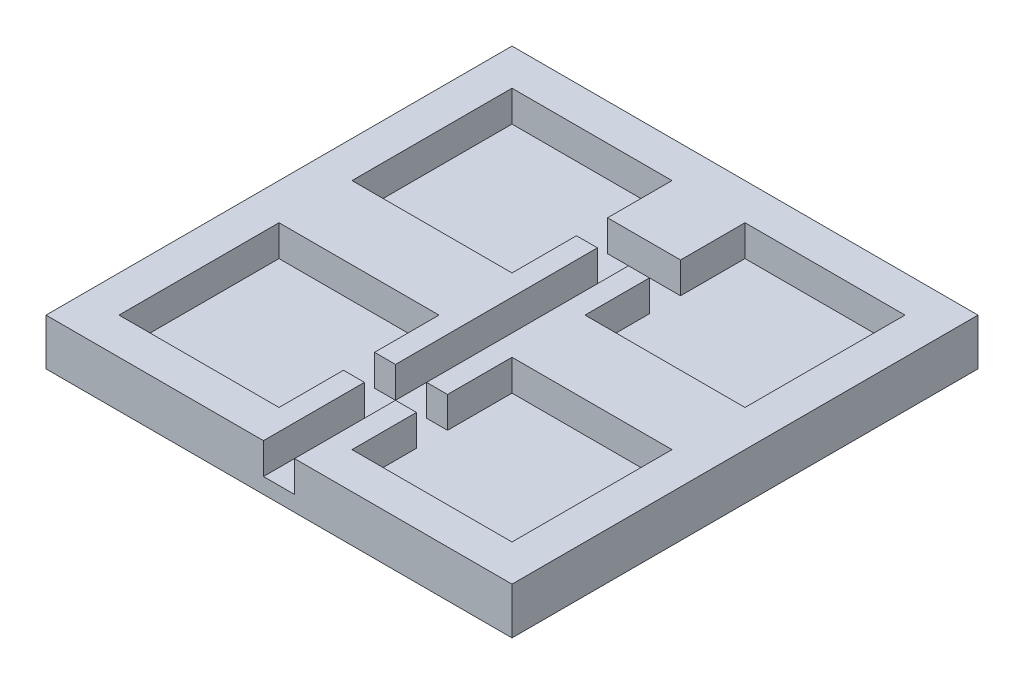
ISO-10303-21;
HEADER;
FILE_DESCRIPTION(('STEP AP214'),'2;1');
FILE_NAME('part.step','',(''),(''),'','','');
FILE_SCHEMA(('AUTOMOTIVE_DESIGN { 1 0 10303 214 1 1 1 1 }'));
ENDSEC;
DATA;
#1=APPLICATION_CONTEXT('core data for automotive mechanical design processes');
#2=APPLICATION_PROTOCOL_DEFINITION('international standard','automotive_design',2000,#1);
#3=PRODUCT_CONTEXT('',#1,'mechanical');
#4=PRODUCT('Part','Part','',(#3));
#5=PRODUCT_RELATED_PRODUCT_CATEGORY('part','',(#4));
#6=PRODUCT_DEFINITION_FORMATION('','',#4);
#7=PRODUCT_DEFINITION_CONTEXT('part definition',#1,'design');
#8=PRODUCT_DEFINITION('design','',#6,#7);
#9=PRODUCT_DEFINITION_SHAPE('','',#8);
#10=(LENGTH_UNIT() NAMED_UNIT(*) SI_UNIT(.MILLI.,.METRE.));
#11=(NAMED_UNIT(*) PLANE_ANGLE_UNIT() SI_UNIT($,.RADIAN.));
#12=(NAMED_UNIT(*) SI_UNIT($,.STERADIAN.) SOLID_ANGLE_UNIT());
#13=UNCERTAINTY_MEASURE_WITH_UNIT(LENGTH_MEASURE(1.E-05),#10,'distance_accuracy_value','');
#14=(GEOMETRIC_REPRESENTATION_CONTEXT(3) GLOBAL_UNCERTAINTY_ASSIGNED_CONTEXT((#13)) GLOBAL_UNIT_ASSIGNED_CONTEXT((#10,
#11,#12)) REPRESENTATION_CONTEXT('',''));
#15=CARTESIAN_POINT('',(0.,0.,0.));
#16=DIRECTION('',(0.,0.,1.));
#17=DIRECTION('',(1.,0.,0.));
#18=AXIS2_PLACEMENT_3D('',#15,#16,#17);
#19=CARTESIAN_POINT('',(2.35000000000002,1.,6.50000000000001));
#20=DIRECTION('',(0.,0.,-1.));
#21=DIRECTION('',(-1.,0.,0.));
#22=AXIS2_PLACEMENT_3D('',#19,#20,#21);
#23=PLANE('',#22);
#24=DIRECTION('',(-1.,0.,0.));
#25=VECTOR('',#24,1.);
#26=CARTESIAN_POINT('',(2.35000000000002,3.,6.50000000000001));
#27=LINE('',#26,#25);
#28=CARTESIAN_POINT('',(2.35000000000002,3.,6.50000000000001));
#29=VERTEX_POINT('',#28);
#30=CARTESIAN_POINT('',(1.,3.,6.50000000000001));
#31=VERTEX_POINT('',#30);
#32=EDGE_CURVE('E537',#29,#31,#27,.T.);
#33=ORIENTED_EDGE('',*,*,#32,.T.);
#34=DIRECTION('',(0.,-1.,0.));
#35=VECTOR('',#34,1.);
#36=CARTESIAN_POINT('',(1.,1.,6.50000000000001));
#37=LINE('',#36,#35);
#38=CARTESIAN_POINT('',(1.,1.,6.50000000000001));
#39=VERTEX_POINT('',#38);
#40=EDGE_CURVE('E304',#31,#39,#37,.T.);
#41=ORIENTED_EDGE('',*,*,#40,.T.);
#42=DIRECTION('',(-1.,0.,0.));
#43=VECTOR('',#42,1.);
#44=CARTESIAN_POINT('',(2.35000000000002,1.,6.50000000000001));
#45=LINE('',#44,#43);
#46=CARTESIAN_POINT('',(2.35000000000002,1.,6.50000000000001));
#47=VERTEX_POINT('',#46);
#48=EDGE_CURVE('E529',#47,#39,#45,.T.);
#49=ORIENTED_EDGE('',*,*,#48,.F.);
#50=DIRECTION('',(0.,1.,0.));
#51=VECTOR('',#50,1.);
#52=CARTESIAN_POINT('',(2.35000000000002,1.,6.50000000000001));
#53=LINE('',#52,#51);
#54=EDGE_CURVE('E543',#47,#29,#53,.T.);
#55=ORIENTED_EDGE('',*,*,#54,.T.);
#56=EDGE_LOOP('',(#33,#41,#49,#55));
#57=FACE_BOUND('',#56,.T.);
#58=ADVANCED_FACE('F33',(#57),#23,.F.);
#59=CARTESIAN_POINT('',(2.35000000000002,1.,8.50000000000001));
#60=DIRECTION('',(0.,0.,1.));
#61=DIRECTION('',(1.,0.,0.));
#62=AXIS2_PLACEMENT_3D('',#59,#60,#61);
#63=PLANE('',#62);
#64=DIRECTION('',(1.,0.,0.));
#65=VECTOR('',#64,1.);
#66=CARTESIAN_POINT('',(2.35000000000002,1.,8.50000000000001));
#67=LINE('',#66,#65);
#68=CARTESIAN_POINT('',(1.,1.,8.50000000000001));
#69=VERTEX_POINT('',#68);
#70=CARTESIAN_POINT('',(2.35000000000002,1.,8.50000000000001));
#71=VERTEX_POINT('',#70);
#72=EDGE_CURVE('E528',#69,#71,#67,.T.);
#73=ORIENTED_EDGE('',*,*,#72,.F.);
#74=DIRECTION('',(0.,1.,0.));
#75=VECTOR('',#74,1.);
#76=CARTESIAN_POINT('',(1.,1.,8.50000000000001));
#77=LINE('',#76,#75);
#78=CARTESIAN_POINT('',(1.,3.,8.50000000000001));
#79=VERTEX_POINT('',#78);
#80=EDGE_CURVE('E520',#69,#79,#77,.T.);
#81=ORIENTED_EDGE('',*,*,#80,.T.);
#82=DIRECTION('',(1.,0.,0.));
#83=VECTOR('',#82,1.);
#84=CARTESIAN_POINT('',(2.35000000000002,3.,8.50000000000001));
#85=LINE('',#84,#83);
#86=CARTESIAN_POINT('',(2.35000000000002,3.,8.50000000000001));
#87=VERTEX_POINT('',#86);
#88=EDGE_CURVE('E309',#79,#87,#85,.T.);
#89=ORIENTED_EDGE('',*,*,#88,.T.);
#90=DIRECTION('',(0.,1.,0.));
#91=VECTOR('',#90,1.);
#92=CARTESIAN_POINT('',(2.35000000000002,1.,8.50000000000001));
#93=LINE('',#92,#91);
#94=EDGE_CURVE('E545',#71,#87,#93,.T.);
#95=ORIENTED_EDGE('',*,*,#94,.F.);
#96=EDGE_LOOP('',(#73,#81,#89,#95));
#97=FACE_BOUND('',#96,.T.);
#98=ADVANCED_FACE('F647',(#97),#63,.F.);
#99=CARTESIAN_POINT('',(-2.35000000000005,1.,-6.50000000000001));
#100=DIRECTION('',(0.,0.,1.));
#101=DIRECTION('',(1.,0.,0.));
#102=AXIS2_PLACEMENT_3D('',#99,#100,#101);
#103=PLANE('',#102);
#104=DIRECTION('',(1.,0.,0.));
#105=VECTOR('',#104,1.);
#106=CARTESIAN_POINT('',(-2.35000000000005,1.,-6.50000000000001));
#107=LINE('',#106,#105);
#108=CARTESIAN_POINT('',(1.,1.,-6.50000000000001));
#109=VERTEX_POINT('',#108);
#110=CARTESIAN_POINT('',(2.35000000000006,1.,-6.5));
#111=VERTEX_POINT('',#110);
#112=EDGE_CURVE('E293',#109,#111,#107,.T.);
#113=ORIENTED_EDGE('',*,*,#112,.F.);
#114=DIRECTION('',(0.,1.,0.));
#115=VECTOR('',#114,1.);
#116=CARTESIAN_POINT('',(1.,1.,-6.50000000000001));
#117=LINE('',#116,#115);
#118=CARTESIAN_POINT('',(1.,3.,-6.50000000000001));
#119=VERTEX_POINT('',#118);
#120=EDGE_CURVE('E56',#109,#119,#117,.T.);
#121=ORIENTED_EDGE('',*,*,#120,.T.);
#122=DIRECTION('',(1.,0.,0.));
#123=VECTOR('',#122,1.);
#124=CARTESIAN_POINT('',(-2.35000000000005,3.,-6.50000000000001));
#125=LINE('',#124,#123);
#126=CARTESIAN_POINT('',(2.35000000000002,3.,-6.50000000000001));
#127=VERTEX_POINT('',#126);
#128=EDGE_CURVE('E303',#119,#127,#125,.T.);
#129=ORIENTED_EDGE('',*,*,#128,.T.);
#130=DIRECTION('',(0.,1.,0.));
#131=VECTOR('',#130,1.);
#132=CARTESIAN_POINT('',(2.35000000000002,1.,-6.50000000000001));
#133=LINE('',#132,#131);
#134=EDGE_CURVE('E306',#111,#127,#133,.T.);
#135=ORIENTED_EDGE('',*,*,#134,.F.);
#136=EDGE_LOOP('',(#113,#121,#129,#135));
#137=FACE_BOUND('',#136,.T.);
#138=ADVANCED_FACE('F587',(#137),#103,.F.);
#139=CARTESIAN_POINT('',(-2.35000000000005,1.,12.65));
#140=DIRECTION('',(1.,0.,0.));
#141=DIRECTION('',(0.,0.,-1.));
#142=AXIS2_PLACEMENT_3D('',#139,#140,#141);
#143=PLANE('',#142);
#144=DIRECTION('',(0.,0.,-1.));
#145=VECTOR('',#144,1.);
#146=CARTESIAN_POINT('',(-2.35000000000005,1.,12.65));
#147=LINE('',#146,#145);
#148=CARTESIAN_POINT('',(-2.35000000000005,1.,6.50000000000001));
#149=VERTEX_POINT('',#148);
#150=CARTESIAN_POINT('',(-2.35000000000003,1.,2.35000000000001));
#151=VERTEX_POINT('',#150);
#152=EDGE_CURVE('E424',#149,#151,#147,.T.);
#153=ORIENTED_EDGE('',*,*,#152,.F.);
#154=DIRECTION('',(0.,1.,0.));
#155=VECTOR('',#154,1.);
#156=CARTESIAN_POINT('',(-2.35000000000005,1.,6.50000000000001));
#157=LINE('',#156,#155);
#158=CARTESIAN_POINT('',(-2.35000000000005,3.,6.50000000000001));
#159=VERTEX_POINT('',#158);
#160=EDGE_CURVE('E540',#149,#159,#157,.T.);
#161=ORIENTED_EDGE('',*,*,#160,.T.);
#162=DIRECTION('',(0.,0.,-1.));
#163=VECTOR('',#162,1.);
#164=CARTESIAN_POINT('',(-2.35000000000005,3.,12.65));
#165=LINE('',#164,#163);
#166=CARTESIAN_POINT('',(-2.35000000000003,3.,2.35000000000001));
#167=VERTEX_POINT('',#166);
#168=EDGE_CURVE('E436',#159,#167,#165,.T.);
#169=ORIENTED_EDGE('',*,*,#168,.T.);
#170=DIRECTION('',(0.,1.,0.));
#171=VECTOR('',#170,1.);
#172=CARTESIAN_POINT('',(-2.35000000000003,1.,2.35000000000001));
#173=LINE('',#172,#171);
#174=EDGE_CURVE('E445',#151,#167,#173,.T.);
#175=ORIENTED_EDGE('',*,*,#174,.F.);
#176=EDGE_LOOP('',(#153,#161,#169,#175));
#177=FACE_BOUND('',#176,.T.);
#178=ADVANCED_FACE('F572',(#177),#143,.F.);
#179=CARTESIAN_POINT('',(-2.34999999999999,1.,-2.35000000000008));
#180=DIRECTION('',(1.,0.,0.));
#181=DIRECTION('',(0.,0.,-1.));
#182=AXIS2_PLACEMENT_3D('',#179,#180,#181);
#183=PLANE('',#182);
#184=DIRECTION('',(0.,0.,-1.));
#185=VECTOR('',#184,1.);
#186=CARTESIAN_POINT('',(-2.34999999999999,3.,-2.35000000000008));
#187=LINE('',#186,#185);
#188=CARTESIAN_POINT('',(-2.34999999999999,3.,-2.35000000000008));
#189=VERTEX_POINT('',#188);
#190=CARTESIAN_POINT('',(-2.35000000000005,3.,-6.50000000000001));
#191=VERTEX_POINT('',#190);
#192=EDGE_CURVE('E333',#189,#191,#187,.T.);
#193=ORIENTED_EDGE('',*,*,#192,.T.);
#194=DIRECTION('',(0.,1.,0.));
#195=VECTOR('',#194,1.);
#196=CARTESIAN_POINT('',(-2.35000000000005,1.,-6.50000000000001));
#197=LINE('',#196,#195);
#198=CARTESIAN_POINT('',(-2.35000000000005,1.,-6.50000000000001));
#199=VERTEX_POINT('',#198);
#200=EDGE_CURVE('E310',#199,#191,#197,.T.);
#201=ORIENTED_EDGE('',*,*,#200,.F.);
#202=DIRECTION('',(0.,0.,-1.));
#203=VECTOR('',#202,1.);
#204=CARTESIAN_POINT('',(-2.34999999999999,1.,-2.35000000000008));
#205=LINE('',#204,#203);
#206=CARTESIAN_POINT('',(-2.34999999999999,1.,-2.35000000000008));
#207=VERTEX_POINT('',#206);
#208=EDGE_CURVE('E291',#207,#199,#205,.T.);
#209=ORIENTED_EDGE('',*,*,#208,.F.);
#210=DIRECTION('',(0.,1.,0.));
#211=VECTOR('',#210,1.);
#212=CARTESIAN_POINT('',(-2.34999999999999,1.,-2.35000000000008));
#213=LINE('',#212,#211);
#214=EDGE_CURVE('E344',#207,#189,#213,.T.);
#215=ORIENTED_EDGE('',*,*,#214,.T.);
#216=EDGE_LOOP('',(#193,#201,#209,#215));
#217=FACE_BOUND('',#216,.T.);
#218=ADVANCED_FACE('F633',(#217),#183,.F.);
#219=CARTESIAN_POINT('',(2.35000000000006,1.,-2.35));
#220=DIRECTION('',(-1.,0.,0.));
#221=DIRECTION('',(0.,0.,1.));
#222=AXIS2_PLACEMENT_3D('',#219,#220,#221);
#223=PLANE('',#222);
#224=DIRECTION('',(0.,0.,1.));
#225=VECTOR('',#224,1.);
#226=CARTESIAN_POINT('',(2.35000000000006,1.,-2.35));
#227=LINE('',#226,#225);
#228=CARTESIAN_POINT('',(2.35000000000006,1.,-2.35));
#229=VERTEX_POINT('',#228);
#230=EDGE_CURVE('E352',#111,#229,#227,.T.);
#231=ORIENTED_EDGE('',*,*,#230,.F.);
#232=ORIENTED_EDGE('',*,*,#134,.T.);
#233=DIRECTION('',(0.,0.,1.));
#234=VECTOR('',#233,1.);
#235=CARTESIAN_POINT('',(2.35000000000006,3.,-2.35));
#236=LINE('',#235,#234);
#237=CARTESIAN_POINT('',(2.35000000000006,3.,-2.35));
#238=VERTEX_POINT('',#237);
#239=EDGE_CURVE('E366',#127,#238,#236,.T.);
#240=ORIENTED_EDGE('',*,*,#239,.T.);
#241=DIRECTION('',(0.,1.,0.));
#242=VECTOR('',#241,1.);
#243=CARTESIAN_POINT('',(2.35000000000006,1.,-2.35));
#244=LINE('',#243,#242);
#245=EDGE_CURVE('E361',#229,#238,#244,.T.);
#246=ORIENTED_EDGE('',*,*,#245,.F.);
#247=EDGE_LOOP('',(#231,#232,#240,#246));
#248=FACE_BOUND('',#247,.T.);
#249=ADVANCED_FACE('F592',(#248),#223,.F.);
#250=CARTESIAN_POINT('',(2.35000000000002,1.,12.65));
#251=DIRECTION('',(-1.,0.,0.));
#252=DIRECTION('',(0.,0.,1.));
#253=AXIS2_PLACEMENT_3D('',#250,#251,#252);
#254=PLANE('',#253);
#255=DIRECTION('',(0.,0.,1.));
#256=VECTOR('',#255,1.);
#257=CARTESIAN_POINT('',(2.35000000000002,3.,12.65));
#258=LINE('',#257,#256);
#259=CARTESIAN_POINT('',(2.35000000000002,3.,2.35000000000004));
#260=VERTEX_POINT('',#259);
#261=EDGE_CURVE('E396',#260,#29,#258,.T.);
#262=ORIENTED_EDGE('',*,*,#261,.T.);
#263=ORIENTED_EDGE('',*,*,#54,.F.);
#264=DIRECTION('',(0.,0.,1.));
#265=VECTOR('',#264,1.);
#266=CARTESIAN_POINT('',(2.35000000000002,1.,12.65));
#267=LINE('',#266,#265);
#268=CARTESIAN_POINT('',(2.35000000000002,1.,2.35000000000004));
#269=VERTEX_POINT('',#268);
#270=EDGE_CURVE('E382',#269,#47,#267,.T.);
#271=ORIENTED_EDGE('',*,*,#270,.F.);
#272=DIRECTION('',(0.,1.,0.));
#273=VECTOR('',#272,1.);
#274=CARTESIAN_POINT('',(2.35000000000002,1.,2.35000000000004));
#275=LINE('',#274,#273);
#276=EDGE_CURVE('E409',#269,#260,#275,.T.);
#277=ORIENTED_EDGE('',*,*,#276,.T.);
#278=EDGE_LOOP('',(#262,#263,#271,#277));
#279=FACE_BOUND('',#278,.T.);
#280=ADVANCED_FACE('F640',(#279),#254,.F.);
#281=CARTESIAN_POINT('',(-15.,3.,-15.));
#282=DIRECTION('',(1.,0.,0.));
#283=DIRECTION('',(0.,0.,-1.));
#284=AXIS2_PLACEMENT_3D('',#281,#282,#283);
#285=PLANE('',#284);
#286=DIRECTION('',(0.,0.,1.));
#287=VECTOR('',#286,1.);
#288=CARTESIAN_POINT('',(-15.,0.,-15.));
#289=LINE('',#288,#287);
#290=CARTESIAN_POINT('',(-15.,0.,-15.));
#291=VERTEX_POINT('',#290);
#292=CARTESIAN_POINT('',(-15.,0.,15.));
#293=VERTEX_POINT('',#292);
#294=EDGE_CURVE('E444',#291,#293,#289,.T.);
#295=ORIENTED_EDGE('',*,*,#294,.T.);
#296=DIRECTION('',(0.,-1.,0.));
#297=VECTOR('',#296,1.);
#298=CARTESIAN_POINT('',(-15.,3.,15.));
#299=LINE('',#298,#297);
#300=CARTESIAN_POINT('',(-15.,3.,15.));
#301=VERTEX_POINT('',#300);
#302=EDGE_CURVE('E11',#301,#293,#299,.T.);
#303=ORIENTED_EDGE('',*,*,#302,.F.);
#304=DIRECTION('',(0.,0.,1.));
#305=VECTOR('',#304,1.);
#306=CARTESIAN_POINT('',(-15.,3.,-15.));
#307=LINE('',#306,#305);
#308=CARTESIAN_POINT('',(-15.,3.,-15.));
#309=VERTEX_POINT('',#308);
#310=EDGE_CURVE('E452',#309,#301,#307,.T.);
#311=ORIENTED_EDGE('',*,*,#310,.F.);
#312=DIRECTION('',(0.,-1.,0.));
#313=VECTOR('',#312,1.);
#314=CARTESIAN_POINT('',(-15.,3.,-15.));
#315=LINE('',#314,#313);
#316=EDGE_CURVE('E464',#309,#291,#315,.T.);
#317=ORIENTED_EDGE('',*,*,#316,.T.);
#318=EDGE_LOOP('',(#295,#303,#311,#317));
#319=FACE_BOUND('',#318,.T.);
#320=ADVANCED_FACE('F35',(#319),#285,.F.);
#321=CARTESIAN_POINT('',(15.,3.,15.));
#322=DIRECTION('',(0.,0.,-1.));
#323=DIRECTION('',(-1.,0.,0.));
#324=AXIS2_PLACEMENT_3D('',#321,#322,#323);
#325=PLANE('',#324);
#326=DIRECTION('',(1.,0.,0.));
#327=VECTOR('',#326,1.);
#328=CARTESIAN_POINT('',(15.,3.,15.));
#329=LINE('',#328,#327);
#330=CARTESIAN_POINT('',(1.,3.,15.));
#331=VERTEX_POINT('',#330);
#332=CARTESIAN_POINT('',(15.,3.,15.));
#333=VERTEX_POINT('',#332);
#334=EDGE_CURVE('E455',#331,#333,#329,.T.);
#335=ORIENTED_EDGE('',*,*,#334,.F.);
#336=DIRECTION('',(0.,1.,0.));
#337=VECTOR('',#336,1.);
#338=CARTESIAN_POINT('',(1.,1.,15.));
#339=LINE('',#338,#337);
#340=CARTESIAN_POINT('',(1.,1.,15.));
#341=VERTEX_POINT('',#340);
#342=EDGE_CURVE('E506',#341,#331,#339,.T.);
#343=ORIENTED_EDGE('',*,*,#342,.F.);
#344=DIRECTION('',(1.,0.,0.));
#345=VECTOR('',#344,1.);
#346=CARTESIAN_POINT('',(-1.,1.,15.));
#347=LINE('',#346,#345);
#348=CARTESIAN_POINT('',(-1.,1.,15.));
#349=VERTEX_POINT('',#348);
#350=EDGE_CURVE('E274',#349,#341,#347,.T.);
#351=ORIENTED_EDGE('',*,*,#350,.F.);
#352=DIRECTION('',(0.,1.,0.));
#353=VECTOR('',#352,1.);
#354=CARTESIAN_POINT('',(-1.,1.,15.));
#355=LINE('',#354,#353);
#356=CARTESIAN_POINT('',(-1.,3.,15.));
#357=VERTEX_POINT('',#356);
#358=EDGE_CURVE('E284',#349,#357,#355,.T.);
#359=ORIENTED_EDGE('',*,*,#358,.T.);
#360=EDGE_CURVE('E457',#301,#357,#329,.T.);
#361=ORIENTED_EDGE('',*,*,#360,.F.);
#362=ORIENTED_EDGE('',*,*,#302,.T.);
#363=DIRECTION('',(1.,0.,0.));
#364=VECTOR('',#363,1.);
#365=CARTESIAN_POINT('',(15.,0.,15.));
#366=LINE('',#365,#364);
#367=CARTESIAN_POINT('',(15.,0.,15.));
#368=VERTEX_POINT('',#367);
#369=EDGE_CURVE('E467',#293,#368,#366,.T.);
#370=ORIENTED_EDGE('',*,*,#369,.T.);
#371=DIRECTION('',(0.,-1.,0.));
#372=VECTOR('',#371,1.);
#373=CARTESIAN_POINT('',(15.,3.,15.));
#374=LINE('',#373,#372);
#375=EDGE_CURVE('E41',#333,#368,#374,.T.);
#376=ORIENTED_EDGE('',*,*,#375,.F.);
#377=EDGE_LOOP('',(#335,#343,#351,#359,#361,#362,#370,#376));
#378=FACE_BOUND('',#377,.T.);
#379=ADVANCED_FACE('F504',(#378),#325,.F.);
#380=CARTESIAN_POINT('',(15.,3.,-15.));
#381=DIRECTION('',(-1.,0.,0.));
#382=DIRECTION('',(0.,0.,1.));
#383=AXIS2_PLACEMENT_3D('',#380,#381,#382);
#384=PLANE('',#383);
#385=DIRECTION('',(0.,0.,-1.));
#386=VECTOR('',#385,1.);
#387=CARTESIAN_POINT('',(15.,0.,-15.));
#388=LINE('',#387,#386);
#389=CARTESIAN_POINT('',(15.,0.,-15.));
#390=VERTEX_POINT('',#389);
#391=EDGE_CURVE('E469',#368,#390,#388,.T.);
#392=ORIENTED_EDGE('',*,*,#391,.T.);
#393=DIRECTION('',(0.,-1.,0.));
#394=VECTOR('',#393,1.);
#395=CARTESIAN_POINT('',(15.,3.,-15.));
#396=LINE('',#395,#394);
#397=CARTESIAN_POINT('',(15.,3.,-15.));
#398=VERTEX_POINT('',#397);
#399=EDGE_CURVE('E474',#398,#390,#396,.T.);
#400=ORIENTED_EDGE('',*,*,#399,.F.);
#401=DIRECTION('',(0.,0.,-1.));
#402=VECTOR('',#401,1.);
#403=CARTESIAN_POINT('',(15.,3.,-15.));
#404=LINE('',#403,#402);
#405=EDGE_CURVE('E460',#333,#398,#404,.T.);
#406=ORIENTED_EDGE('',*,*,#405,.F.);
#407=ORIENTED_EDGE('',*,*,#375,.T.);
#408=EDGE_LOOP('',(#392,#400,#406,#407));
#409=FACE_BOUND('',#408,.T.);
#410=ADVANCED_FACE('F481',(#409),#384,.F.);
#411=CARTESIAN_POINT('',(15.,3.,-15.));
#412=DIRECTION('',(0.,0.,1.));
#413=DIRECTION('',(1.,0.,0.));
#414=AXIS2_PLACEMENT_3D('',#411,#412,#413);
#415=PLANE('',#414);
#416=DIRECTION('',(-1.,0.,0.));
#417=VECTOR('',#416,1.);
#418=CARTESIAN_POINT('',(15.,0.,-15.));
#419=LINE('',#418,#417);
#420=EDGE_CURVE('E456',#390,#291,#419,.T.);
#421=ORIENTED_EDGE('',*,*,#420,.T.);
#422=ORIENTED_EDGE('',*,*,#316,.F.);
#423=DIRECTION('',(-1.,0.,0.));
#424=VECTOR('',#423,1.);
#425=CARTESIAN_POINT('',(15.,3.,-15.));
#426=LINE('',#425,#424);
#427=EDGE_CURVE('E462',#398,#309,#426,.T.);
#428=ORIENTED_EDGE('',*,*,#427,.F.);
#429=ORIENTED_EDGE('',*,*,#399,.T.);
#430=EDGE_LOOP('',(#421,#422,#428,#429));
#431=FACE_BOUND('',#430,.T.);
#432=ADVANCED_FACE('F491',(#431),#415,.F.);
#433=CARTESIAN_POINT('',(0.,3.,0.));
#434=DIRECTION('',(0.,-1.,0.));
#435=DIRECTION('',(0.,0.,-1.));
#436=AXIS2_PLACEMENT_3D('',#433,#434,#435);
#437=PLANE('',#436);
#438=ORIENTED_EDGE('',*,*,#128,.F.);
#439=DIRECTION('',(0.,0.,-1.));
#440=VECTOR('',#439,1.);
#441=CARTESIAN_POINT('',(1.,3.,-6.50000000000001));
#442=LINE('',#441,#440);
#443=EDGE_CURVE('E581',#31,#119,#442,.T.);
#444=ORIENTED_EDGE('',*,*,#443,.F.);
#445=ORIENTED_EDGE('',*,*,#32,.F.);
#446=ORIENTED_EDGE('',*,*,#261,.F.);
#447=DIRECTION('',(-1.,0.,0.));
#448=VECTOR('',#447,1.);
#449=CARTESIAN_POINT('',(12.65,3.,2.35000000000004));
#450=LINE('',#449,#448);
#451=CARTESIAN_POINT('',(12.65,3.,2.35000000000004));
#452=VERTEX_POINT('',#451);
#453=EDGE_CURVE('E406',#452,#260,#450,.T.);
#454=ORIENTED_EDGE('',*,*,#453,.F.);
#455=DIRECTION('',(0.,0.,-1.));
#456=VECTOR('',#455,1.);
#457=CARTESIAN_POINT('',(12.65,3.,12.65));
#458=LINE('',#457,#456);
#459=CARTESIAN_POINT('',(12.65,3.,12.65));
#460=VERTEX_POINT('',#459);
#461=EDGE_CURVE('E403',#460,#452,#458,.T.);
#462=ORIENTED_EDGE('',*,*,#461,.F.);
#463=DIRECTION('',(1.,0.,0.));
#464=VECTOR('',#463,1.);
#465=CARTESIAN_POINT('',(12.65,3.,12.65));
#466=LINE('',#465,#464);
#467=CARTESIAN_POINT('',(2.35000000000002,3.,12.65));
#468=VERTEX_POINT('',#467);
#469=EDGE_CURVE('E399',#468,#460,#466,.T.);
#470=ORIENTED_EDGE('',*,*,#469,.F.);
#471=EDGE_CURVE('E400',#87,#468,#258,.T.);
#472=ORIENTED_EDGE('',*,*,#471,.F.);
#473=ORIENTED_EDGE('',*,*,#88,.F.);
#474=EDGE_CURVE('E502',#331,#79,#442,.T.);
#475=ORIENTED_EDGE('',*,*,#474,.F.);
#476=ORIENTED_EDGE('',*,*,#334,.T.);
#477=ORIENTED_EDGE('',*,*,#405,.T.);
#478=ORIENTED_EDGE('',*,*,#427,.T.);
#479=ORIENTED_EDGE('',*,*,#310,.T.);
#480=ORIENTED_EDGE('',*,*,#360,.T.);
#481=DIRECTION('',(0.,0.,1.));
#482=VECTOR('',#481,1.);
#483=CARTESIAN_POINT('',(-1.,3.,-6.50000000000001));
#484=LINE('',#483,#482);
#485=CARTESIAN_POINT('',(-1.,3.,8.50000000000001));
#486=VERTEX_POINT('',#485);
#487=EDGE_CURVE('E555',#486,#357,#484,.T.);
#488=ORIENTED_EDGE('',*,*,#487,.F.);
#489=CARTESIAN_POINT('',(-2.35000000000005,3.,8.50000000000001));
#490=VERTEX_POINT('',#489);
#491=EDGE_CURVE('E533',#490,#486,#85,.T.);
#492=ORIENTED_EDGE('',*,*,#491,.F.);
#493=CARTESIAN_POINT('',(-2.35000000000005,3.,12.65));
#494=VERTEX_POINT('',#493);
#495=EDGE_CURVE('E437',#494,#490,#165,.T.);
#496=ORIENTED_EDGE('',*,*,#495,.F.);
#497=DIRECTION('',(1.,0.,0.));
#498=VECTOR('',#497,1.);
#499=CARTESIAN_POINT('',(-2.35000000000005,3.,12.65));
#500=LINE('',#499,#498);
#501=CARTESIAN_POINT('',(-12.65,3.,12.65));
#502=VERTEX_POINT('',#501);
#503=EDGE_CURVE('E433',#502,#494,#500,.T.);
#504=ORIENTED_EDGE('',*,*,#503,.F.);
#505=DIRECTION('',(0.,0.,1.));
#506=VECTOR('',#505,1.);
#507=CARTESIAN_POINT('',(-12.65,3.,12.65));
#508=LINE('',#507,#506);
#509=CARTESIAN_POINT('',(-12.65,3.,2.35000000000001));
#510=VERTEX_POINT('',#509);
#511=EDGE_CURVE('E340',#510,#502,#508,.T.);
#512=ORIENTED_EDGE('',*,*,#511,.F.);
#513=DIRECTION('',(-1.,0.,0.));
#514=VECTOR('',#513,1.);
#515=CARTESIAN_POINT('',(-2.35000000000003,3.,2.35000000000001));
#516=LINE('',#515,#514);
#517=EDGE_CURVE('E421',#167,#510,#516,.T.);
#518=ORIENTED_EDGE('',*,*,#517,.F.);
#519=ORIENTED_EDGE('',*,*,#168,.F.);
#520=CARTESIAN_POINT('',(-1.,3.,6.50000000000001));
#521=VERTEX_POINT('',#520);
#522=EDGE_CURVE('E536',#521,#159,#27,.T.);
#523=ORIENTED_EDGE('',*,*,#522,.F.);
#524=CARTESIAN_POINT('',(-1.,3.,-6.50000000000001));
#525=VERTEX_POINT('',#524);
#526=EDGE_CURVE('E515',#525,#521,#484,.T.);
#527=ORIENTED_EDGE('',*,*,#526,.F.);
#528=EDGE_CURVE('E283',#191,#525,#125,.T.);
#529=ORIENTED_EDGE('',*,*,#528,.F.);
#530=ORIENTED_EDGE('',*,*,#192,.F.);
#531=DIRECTION('',(1.,0.,0.));
#532=VECTOR('',#531,1.);
#533=CARTESIAN_POINT('',(-2.34999999999999,3.,-2.35000000000008));
#534=LINE('',#533,#532);
#535=CARTESIAN_POINT('',(-12.65,3.,-2.35000000000008));
#536=VERTEX_POINT('',#535);
#537=EDGE_CURVE('E328',#536,#189,#534,.T.);
#538=ORIENTED_EDGE('',*,*,#537,.F.);
#539=DIRECTION('',(0.,0.,1.));
#540=VECTOR('',#539,1.);
#541=CARTESIAN_POINT('',(-12.65,3.,-2.35000000000008));
#542=LINE('',#541,#540);
#543=CARTESIAN_POINT('',(-12.65,3.,-12.6500000000001));
#544=VERTEX_POINT('',#543);
#545=EDGE_CURVE('E326',#544,#536,#542,.T.);
#546=ORIENTED_EDGE('',*,*,#545,.F.);
#547=DIRECTION('',(-1.,0.,0.));
#548=VECTOR('',#547,1.);
#549=CARTESIAN_POINT('',(-2.34999999999999,3.,-12.6500000000001));
#550=LINE('',#549,#548);
#551=CARTESIAN_POINT('',(-2.34999999999999,3.,-12.6500000000001));
#552=VERTEX_POINT('',#551);
#553=EDGE_CURVE('E318',#552,#544,#550,.T.);
#554=ORIENTED_EDGE('',*,*,#553,.F.);
#555=CARTESIAN_POINT('',(-2.35000000000005,3.,-8.5));
#556=VERTEX_POINT('',#555);
#557=EDGE_CURVE('E332',#556,#552,#187,.T.);
#558=ORIENTED_EDGE('',*,*,#557,.F.);
#559=DIRECTION('',(-1.,0.,0.));
#560=VECTOR('',#559,1.);
#561=CARTESIAN_POINT('',(-2.35000000000005,3.,-8.5));
#562=LINE('',#561,#560);
#563=CARTESIAN_POINT('',(2.35000000000002,3.,-8.5));
#564=VERTEX_POINT('',#563);
#565=EDGE_CURVE('E301',#564,#556,#562,.T.);
#566=ORIENTED_EDGE('',*,*,#565,.F.);
#567=CARTESIAN_POINT('',(2.35000000000006,3.,-12.65));
#568=VERTEX_POINT('',#567);
#569=EDGE_CURVE('E362',#568,#564,#236,.T.);
#570=ORIENTED_EDGE('',*,*,#569,.F.);
#571=DIRECTION('',(-1.,0.,0.));
#572=VECTOR('',#571,1.);
#573=CARTESIAN_POINT('',(12.6500000000001,3.,-12.65));
#574=LINE('',#573,#572);
#575=CARTESIAN_POINT('',(12.6500000000001,3.,-12.65));
#576=VERTEX_POINT('',#575);
#577=EDGE_CURVE('E372',#576,#568,#574,.T.);
#578=ORIENTED_EDGE('',*,*,#577,.F.);
#579=DIRECTION('',(0.,0.,-1.));
#580=VECTOR('',#579,1.);
#581=CARTESIAN_POINT('',(12.6500000000001,3.,-2.35000000000001));
#582=LINE('',#581,#580);
#583=CARTESIAN_POINT('',(12.6500000000001,3.,-2.35000000000001));
#584=VERTEX_POINT('',#583);
#585=EDGE_CURVE('E369',#584,#576,#582,.T.);
#586=ORIENTED_EDGE('',*,*,#585,.F.);
#587=DIRECTION('',(1.,0.,0.));
#588=VECTOR('',#587,1.);
#589=CARTESIAN_POINT('',(12.6500000000001,3.,-2.35000000000001));
#590=LINE('',#589,#588);
#591=EDGE_CURVE('E365',#238,#584,#590,.T.);
#592=ORIENTED_EDGE('',*,*,#591,.F.);
#593=ORIENTED_EDGE('',*,*,#239,.F.);
#594=EDGE_LOOP('',(#438,#444,#445,#446,#454,#462,#470,#472,#473,#475,#476,#477,#478,#479,#480,
#488,#492,#496,#504,#512,#518,#519,#523,#527,#529,#530,#538,#546,#554,#558,#566,#570,#578,#586,
#592,#593));
#595=FACE_BOUND('',#594,.T.);
#596=ADVANCED_FACE('F498',(#595),#437,.F.);
#597=CARTESIAN_POINT('',(0.,0.,0.));
#598=DIRECTION('',(0.,-1.,0.));
#599=DIRECTION('',(0.,0.,-1.));
#600=AXIS2_PLACEMENT_3D('',#597,#598,#599);
#601=PLANE('',#600);
#602=ORIENTED_EDGE('',*,*,#294,.F.);
#603=ORIENTED_EDGE('',*,*,#420,.F.);
#604=ORIENTED_EDGE('',*,*,#391,.F.);
#605=ORIENTED_EDGE('',*,*,#369,.F.);
#606=EDGE_LOOP('',(#602,#603,#604,#605));
#607=FACE_BOUND('',#606,.T.);
#608=ADVANCED_FACE('F488',(#607),#601,.T.);
#609=CARTESIAN_POINT('',(-12.65,1.,12.65));
#610=DIRECTION('',(-1.,0.,0.));
#611=DIRECTION('',(0.,0.,1.));
#612=AXIS2_PLACEMENT_3D('',#609,#610,#611);
#613=PLANE('',#612);
#614=ORIENTED_EDGE('',*,*,#511,.T.);
#615=DIRECTION('',(0.,1.,0.));
#616=VECTOR('',#615,1.);
#617=CARTESIAN_POINT('',(-12.65,1.,12.65));
#618=LINE('',#617,#616);
#619=CARTESIAN_POINT('',(-12.65,1.,12.65));
#620=VERTEX_POINT('',#619);
#621=EDGE_CURVE('E431',#620,#502,#618,.T.);
#622=ORIENTED_EDGE('',*,*,#621,.F.);
#623=DIRECTION('',(0.,0.,1.));
#624=VECTOR('',#623,1.);
#625=CARTESIAN_POINT('',(-12.65,1.,12.65));
#626=LINE('',#625,#624);
#627=CARTESIAN_POINT('',(-12.65,1.,2.35000000000001));
#628=VERTEX_POINT('',#627);
#629=EDGE_CURVE('E417',#628,#620,#626,.T.);
#630=ORIENTED_EDGE('',*,*,#629,.F.);
#631=DIRECTION('',(0.,1.,0.));
#632=VECTOR('',#631,1.);
#633=CARTESIAN_POINT('',(-12.65,1.,2.35000000000001));
#634=LINE('',#633,#632);
#635=EDGE_CURVE('E442',#628,#510,#634,.T.);
#636=ORIENTED_EDGE('',*,*,#635,.T.);
#637=EDGE_LOOP('',(#614,#622,#630,#636));
#638=FACE_BOUND('',#637,.T.);
#639=ADVANCED_FACE('F564',(#638),#613,.F.);
#640=CARTESIAN_POINT('',(-2.35000000000003,1.,2.35000000000001));
#641=DIRECTION('',(0.,0.,-1.));
#642=DIRECTION('',(-1.,0.,0.));
#643=AXIS2_PLACEMENT_3D('',#640,#641,#642);
#644=PLANE('',#643);
#645=ORIENTED_EDGE('',*,*,#517,.T.);
#646=ORIENTED_EDGE('',*,*,#635,.F.);
#647=DIRECTION('',(-1.,0.,0.));
#648=VECTOR('',#647,1.);
#649=CARTESIAN_POINT('',(-2.35000000000003,1.,2.35000000000001));
#650=LINE('',#649,#648);
#651=EDGE_CURVE('E428',#151,#628,#650,.T.);
#652=ORIENTED_EDGE('',*,*,#651,.F.);
#653=ORIENTED_EDGE('',*,*,#174,.T.);
#654=EDGE_LOOP('',(#645,#646,#652,#653));
#655=FACE_BOUND('',#654,.T.);
#656=ADVANCED_FACE('F568',(#655),#644,.F.);
#657=ORIENTED_EDGE('',*,*,#495,.T.);
#658=DIRECTION('',(0.,1.,0.));
#659=VECTOR('',#658,1.);
#660=CARTESIAN_POINT('',(-2.35000000000005,1.,8.50000000000001));
#661=LINE('',#660,#659);
#662=CARTESIAN_POINT('',(-2.35000000000005,1.,8.50000000000001));
#663=VERTEX_POINT('',#662);
#664=EDGE_CURVE('E532',#663,#490,#661,.T.);
#665=ORIENTED_EDGE('',*,*,#664,.F.);
#666=CARTESIAN_POINT('',(-2.35000000000005,1.,12.65));
#667=VERTEX_POINT('',#666);
#668=EDGE_CURVE('E425',#667,#663,#147,.T.);
#669=ORIENTED_EDGE('',*,*,#668,.F.);
#670=DIRECTION('',(0.,1.,0.));
#671=VECTOR('',#670,1.);
#672=CARTESIAN_POINT('',(-2.35000000000005,1.,12.65));
#673=LINE('',#672,#671);
#674=EDGE_CURVE('E448',#667,#494,#673,.T.);
#675=ORIENTED_EDGE('',*,*,#674,.T.);
#676=EDGE_LOOP('',(#657,#665,#669,#675));
#677=FACE_BOUND('',#676,.T.);
#678=ADVANCED_FACE('F556',(#677),#143,.F.);
#679=CARTESIAN_POINT('',(-2.35000000000005,1.,12.65));
#680=DIRECTION('',(0.,0.,1.));
#681=DIRECTION('',(1.,0.,0.));
#682=AXIS2_PLACEMENT_3D('',#679,#680,#681);
#683=PLANE('',#682);
#684=ORIENTED_EDGE('',*,*,#503,.T.);
#685=ORIENTED_EDGE('',*,*,#674,.F.);
#686=DIRECTION('',(1.,0.,0.));
#687=VECTOR('',#686,1.);
#688=CARTESIAN_POINT('',(-2.35000000000005,1.,12.65));
#689=LINE('',#688,#687);
#690=EDGE_CURVE('E420',#620,#667,#689,.T.);
#691=ORIENTED_EDGE('',*,*,#690,.F.);
#692=ORIENTED_EDGE('',*,*,#621,.T.);
#693=EDGE_LOOP('',(#684,#685,#691,#692));
#694=FACE_BOUND('',#693,.T.);
#695=ADVANCED_FACE('F559',(#694),#683,.F.);
#696=CARTESIAN_POINT('',(-12.65,1.,-2.35000000000008));
#697=DIRECTION('',(-1.,0.,0.));
#698=DIRECTION('',(0.,0.,1.));
#699=AXIS2_PLACEMENT_3D('',#696,#697,#698);
#700=PLANE('',#699);
#701=ORIENTED_EDGE('',*,*,#545,.T.);
#702=DIRECTION('',(0.,1.,0.));
#703=VECTOR('',#702,1.);
#704=CARTESIAN_POINT('',(-12.65,1.,-2.35000000000008));
#705=LINE('',#704,#703);
#706=CARTESIAN_POINT('',(-12.65,1.,-2.35000000000008));
#707=VERTEX_POINT('',#706);
#708=EDGE_CURVE('E325',#707,#536,#705,.T.);
#709=ORIENTED_EDGE('',*,*,#708,.F.);
#710=DIRECTION('',(0.,0.,1.));
#711=VECTOR('',#710,1.);
#712=CARTESIAN_POINT('',(-12.65,1.,-2.35000000000008));
#713=LINE('',#712,#711);
#714=CARTESIAN_POINT('',(-12.65,1.,-12.6500000000001));
#715=VERTEX_POINT('',#714);
#716=EDGE_CURVE('E314',#715,#707,#713,.T.);
#717=ORIENTED_EDGE('',*,*,#716,.F.);
#718=DIRECTION('',(0.,1.,0.));
#719=VECTOR('',#718,1.);
#720=CARTESIAN_POINT('',(-12.65,1.,-12.6500000000001));
#721=LINE('',#720,#719);
#722=EDGE_CURVE('E338',#715,#544,#721,.T.);
#723=ORIENTED_EDGE('',*,*,#722,.T.);
#724=EDGE_LOOP('',(#701,#709,#717,#723));
#725=FACE_BOUND('',#724,.T.);
#726=ADVANCED_FACE('F627',(#725),#700,.F.);
#727=CARTESIAN_POINT('',(-2.34999999999999,1.,-12.6500000000001));
#728=DIRECTION('',(0.,0.,-1.));
#729=DIRECTION('',(-1.,0.,0.));
#730=AXIS2_PLACEMENT_3D('',#727,#728,#729);
#731=PLANE('',#730);
#732=ORIENTED_EDGE('',*,*,#553,.T.);
#733=ORIENTED_EDGE('',*,*,#722,.F.);
#734=DIRECTION('',(-1.,0.,0.));
#735=VECTOR('',#734,1.);
#736=CARTESIAN_POINT('',(-2.34999999999999,1.,-12.6500000000001));
#737=LINE('',#736,#735);
#738=CARTESIAN_POINT('',(-2.34999999999999,1.,-12.6500000000001));
#739=VERTEX_POINT('',#738);
#740=EDGE_CURVE('E322',#739,#715,#737,.T.);
#741=ORIENTED_EDGE('',*,*,#740,.F.);
#742=DIRECTION('',(0.,1.,0.));
#743=VECTOR('',#742,1.);
#744=CARTESIAN_POINT('',(-2.34999999999999,1.,-12.6500000000001));
#745=LINE('',#744,#743);
#746=EDGE_CURVE('E341',#739,#552,#745,.T.);
#747=ORIENTED_EDGE('',*,*,#746,.T.);
#748=EDGE_LOOP('',(#732,#733,#741,#747));
#749=FACE_BOUND('',#748,.T.);
#750=ADVANCED_FACE('F623',(#749),#731,.F.);
#751=CARTESIAN_POINT('',(-2.35000000000005,1.,-8.5));
#752=VERTEX_POINT('',#751);
#753=EDGE_CURVE('E320',#752,#739,#205,.T.);
#754=ORIENTED_EDGE('',*,*,#753,.F.);
#755=DIRECTION('',(0.,1.,0.));
#756=VECTOR('',#755,1.);
#757=CARTESIAN_POINT('',(-2.35000000000005,1.,-8.5));
#758=LINE('',#757,#756);
#759=EDGE_CURVE('E295',#752,#556,#758,.T.);
#760=ORIENTED_EDGE('',*,*,#759,.T.);
#761=ORIENTED_EDGE('',*,*,#557,.T.);
#762=ORIENTED_EDGE('',*,*,#746,.F.);
#763=EDGE_LOOP('',(#754,#760,#761,#762));
#764=FACE_BOUND('',#763,.T.);
#765=ADVANCED_FACE('F620',(#764),#183,.F.);
#766=CARTESIAN_POINT('',(-2.34999999999999,1.,-2.35000000000008));
#767=DIRECTION('',(0.,0.,1.));
#768=DIRECTION('',(1.,0.,0.));
#769=AXIS2_PLACEMENT_3D('',#766,#767,#768);
#770=PLANE('',#769);
#771=ORIENTED_EDGE('',*,*,#537,.T.);
#772=ORIENTED_EDGE('',*,*,#214,.F.);
#773=DIRECTION('',(1.,0.,0.));
#774=VECTOR('',#773,1.);
#775=CARTESIAN_POINT('',(-2.34999999999999,1.,-2.35000000000008));
#776=LINE('',#775,#774);
#777=EDGE_CURVE('E317',#707,#207,#776,.T.);
#778=ORIENTED_EDGE('',*,*,#777,.F.);
#779=ORIENTED_EDGE('',*,*,#708,.T.);
#780=EDGE_LOOP('',(#771,#772,#778,#779));
#781=FACE_BOUND('',#780,.T.);
#782=ADVANCED_FACE('F630',(#781),#770,.F.);
#783=ORIENTED_EDGE('',*,*,#569,.T.);
#784=DIRECTION('',(0.,1.,0.));
#785=VECTOR('',#784,1.);
#786=CARTESIAN_POINT('',(2.35000000000002,1.,-8.5));
#787=LINE('',#786,#785);
#788=CARTESIAN_POINT('',(2.35000000000002,1.,-8.5));
#789=VERTEX_POINT('',#788);
#790=EDGE_CURVE('E292',#789,#564,#787,.T.);
#791=ORIENTED_EDGE('',*,*,#790,.F.);
#792=CARTESIAN_POINT('',(2.35000000000006,1.,-12.65));
#793=VERTEX_POINT('',#792);
#794=EDGE_CURVE('E348',#793,#789,#227,.T.);
#795=ORIENTED_EDGE('',*,*,#794,.F.);
#796=DIRECTION('',(0.,1.,0.));
#797=VECTOR('',#796,1.);
#798=CARTESIAN_POINT('',(2.35000000000006,1.,-12.65));
#799=LINE('',#798,#797);
#800=EDGE_CURVE('E329',#793,#568,#799,.T.);
#801=ORIENTED_EDGE('',*,*,#800,.T.);
#802=EDGE_LOOP('',(#783,#791,#795,#801));
#803=FACE_BOUND('',#802,.T.);
#804=ADVANCED_FACE('F611',(#803),#223,.F.);
#805=CARTESIAN_POINT('',(12.6500000000001,1.,-12.65));
#806=DIRECTION('',(0.,0.,-1.));
#807=DIRECTION('',(-1.,0.,0.));
#808=AXIS2_PLACEMENT_3D('',#805,#806,#807);
#809=PLANE('',#808);
#810=ORIENTED_EDGE('',*,*,#577,.T.);
#811=ORIENTED_EDGE('',*,*,#800,.F.);
#812=DIRECTION('',(-1.,0.,0.));
#813=VECTOR('',#812,1.);
#814=CARTESIAN_POINT('',(12.6500000000001,1.,-12.65));
#815=LINE('',#814,#813);
#816=CARTESIAN_POINT('',(12.6500000000001,1.,-12.65));
#817=VERTEX_POINT('',#816);
#818=EDGE_CURVE('E358',#817,#793,#815,.T.);
#819=ORIENTED_EDGE('',*,*,#818,.F.);
#820=DIRECTION('',(0.,1.,0.));
#821=VECTOR('',#820,1.);
#822=CARTESIAN_POINT('',(12.6500000000001,1.,-12.65));
#823=LINE('',#822,#821);
#824=EDGE_CURVE('E376',#817,#576,#823,.T.);
#825=ORIENTED_EDGE('',*,*,#824,.T.);
#826=EDGE_LOOP('',(#810,#811,#819,#825));
#827=FACE_BOUND('',#826,.T.);
#828=ADVANCED_FACE('F604',(#827),#809,.F.);
#829=CARTESIAN_POINT('',(12.6500000000001,1.,-2.35000000000001));
#830=DIRECTION('',(1.,0.,0.));
#831=DIRECTION('',(0.,0.,-1.));
#832=AXIS2_PLACEMENT_3D('',#829,#830,#831);
#833=PLANE('',#832);
#834=ORIENTED_EDGE('',*,*,#585,.T.);
#835=ORIENTED_EDGE('',*,*,#824,.F.);
#836=DIRECTION('',(0.,0.,-1.));
#837=VECTOR('',#836,1.);
#838=CARTESIAN_POINT('',(12.6500000000001,1.,-2.35000000000001));
#839=LINE('',#838,#837);
#840=CARTESIAN_POINT('',(12.6500000000001,1.,-2.35000000000001));
#841=VERTEX_POINT('',#840);
#842=EDGE_CURVE('E355',#841,#817,#839,.T.);
#843=ORIENTED_EDGE('',*,*,#842,.F.);
#844=DIRECTION('',(0.,1.,0.));
#845=VECTOR('',#844,1.);
#846=CARTESIAN_POINT('',(12.6500000000001,1.,-2.35000000000001));
#847=LINE('',#846,#845);
#848=EDGE_CURVE('E378',#841,#584,#847,.T.);
#849=ORIENTED_EDGE('',*,*,#848,.T.);
#850=EDGE_LOOP('',(#834,#835,#843,#849));
#851=FACE_BOUND('',#850,.T.);
#852=ADVANCED_FACE('F601',(#851),#833,.F.);
#853=CARTESIAN_POINT('',(12.6500000000001,1.,-2.35000000000001));
#854=DIRECTION('',(0.,0.,1.));
#855=DIRECTION('',(1.,0.,0.));
#856=AXIS2_PLACEMENT_3D('',#853,#854,#855);
#857=PLANE('',#856);
#858=ORIENTED_EDGE('',*,*,#591,.T.);
#859=ORIENTED_EDGE('',*,*,#848,.F.);
#860=DIRECTION('',(1.,0.,0.));
#861=VECTOR('',#860,1.);
#862=CARTESIAN_POINT('',(12.6500000000001,1.,-2.35000000000001));
#863=LINE('',#862,#861);
#864=EDGE_CURVE('E351',#229,#841,#863,.T.);
#865=ORIENTED_EDGE('',*,*,#864,.F.);
#866=ORIENTED_EDGE('',*,*,#245,.T.);
#867=EDGE_LOOP('',(#858,#859,#865,#866));
#868=FACE_BOUND('',#867,.T.);
#869=ADVANCED_FACE('F597',(#868),#857,.F.);
#870=CARTESIAN_POINT('',(2.35000000000002,1.,12.65));
#871=VERTEX_POINT('',#870);
#872=EDGE_CURVE('E386',#71,#871,#267,.T.);
#873=ORIENTED_EDGE('',*,*,#872,.F.);
#874=ORIENTED_EDGE('',*,*,#94,.T.);
#875=ORIENTED_EDGE('',*,*,#471,.T.);
#876=DIRECTION('',(0.,1.,0.));
#877=VECTOR('',#876,1.);
#878=CARTESIAN_POINT('',(2.35000000000002,1.,12.65));
#879=LINE('',#878,#877);
#880=EDGE_CURVE('E395',#871,#468,#879,.T.);
#881=ORIENTED_EDGE('',*,*,#880,.F.);
#882=EDGE_LOOP('',(#873,#874,#875,#881));
#883=FACE_BOUND('',#882,.T.);
#884=ADVANCED_FACE('F674',(#883),#254,.F.);
#885=CARTESIAN_POINT('',(12.65,1.,2.35000000000004));
#886=DIRECTION('',(0.,0.,-1.));
#887=DIRECTION('',(-1.,0.,0.));
#888=AXIS2_PLACEMENT_3D('',#885,#886,#887);
#889=PLANE('',#888);
#890=ORIENTED_EDGE('',*,*,#453,.T.);
#891=ORIENTED_EDGE('',*,*,#276,.F.);
#892=DIRECTION('',(-1.,0.,0.));
#893=VECTOR('',#892,1.);
#894=CARTESIAN_POINT('',(12.65,1.,2.35000000000004));
#895=LINE('',#894,#893);
#896=CARTESIAN_POINT('',(12.65,1.,2.35000000000004));
#897=VERTEX_POINT('',#896);
#898=EDGE_CURVE('E392',#897,#269,#895,.T.);
#899=ORIENTED_EDGE('',*,*,#898,.F.);
#900=DIRECTION('',(0.,1.,0.));
#901=VECTOR('',#900,1.);
#902=CARTESIAN_POINT('',(12.65,1.,2.35000000000004));
#903=LINE('',#902,#901);
#904=EDGE_CURVE('E411',#897,#452,#903,.T.);
#905=ORIENTED_EDGE('',*,*,#904,.T.);
#906=EDGE_LOOP('',(#890,#891,#899,#905));
#907=FACE_BOUND('',#906,.T.);
#908=ADVANCED_FACE('F671',(#907),#889,.F.);
#909=CARTESIAN_POINT('',(12.65,1.,12.65));
#910=DIRECTION('',(1.,0.,0.));
#911=DIRECTION('',(0.,0.,-1.));
#912=AXIS2_PLACEMENT_3D('',#909,#910,#911);
#913=PLANE('',#912);
#914=ORIENTED_EDGE('',*,*,#461,.T.);
#915=ORIENTED_EDGE('',*,*,#904,.F.);
#916=DIRECTION('',(0.,0.,-1.));
#917=VECTOR('',#916,1.);
#918=CARTESIAN_POINT('',(12.65,1.,12.65));
#919=LINE('',#918,#917);
#920=CARTESIAN_POINT('',(12.65,1.,12.65));
#921=VERTEX_POINT('',#920);
#922=EDGE_CURVE('E389',#921,#897,#919,.T.);
#923=ORIENTED_EDGE('',*,*,#922,.F.);
#924=DIRECTION('',(0.,1.,0.));
#925=VECTOR('',#924,1.);
#926=CARTESIAN_POINT('',(12.65,1.,12.65));
#927=LINE('',#926,#925);
#928=EDGE_CURVE('E413',#921,#460,#927,.T.);
#929=ORIENTED_EDGE('',*,*,#928,.T.);
#930=EDGE_LOOP('',(#914,#915,#923,#929));
#931=FACE_BOUND('',#930,.T.);
#932=ADVANCED_FACE('F666',(#931),#913,.F.);
#933=CARTESIAN_POINT('',(12.65,1.,12.65));
#934=DIRECTION('',(0.,0.,1.));
#935=DIRECTION('',(1.,0.,0.));
#936=AXIS2_PLACEMENT_3D('',#933,#934,#935);
#937=PLANE('',#936);
#938=ORIENTED_EDGE('',*,*,#469,.T.);
#939=ORIENTED_EDGE('',*,*,#928,.F.);
#940=DIRECTION('',(1.,0.,0.));
#941=VECTOR('',#940,1.);
#942=CARTESIAN_POINT('',(12.65,1.,12.65));
#943=LINE('',#942,#941);
#944=EDGE_CURVE('E385',#871,#921,#943,.T.);
#945=ORIENTED_EDGE('',*,*,#944,.F.);
#946=ORIENTED_EDGE('',*,*,#880,.T.);
#947=EDGE_LOOP('',(#938,#939,#945,#946));
#948=FACE_BOUND('',#947,.T.);
#949=ADVANCED_FACE('F661',(#948),#937,.F.);
#950=CARTESIAN_POINT('',(0.,1.,0.));
#951=DIRECTION('',(0.,1.,0.));
#952=DIRECTION('',(0.,0.,1.));
#953=AXIS2_PLACEMENT_3D('',#950,#951,#952);
#954=PLANE('',#953);
#955=CARTESIAN_POINT('',(-1.,1.,8.50000000000001));
#956=VERTEX_POINT('',#955);
#957=EDGE_CURVE('E525',#663,#956,#67,.T.);
#958=ORIENTED_EDGE('',*,*,#957,.T.);
#959=DIRECTION('',(0.,0.,1.));
#960=VECTOR('',#959,1.);
#961=CARTESIAN_POINT('',(-1.,1.,-6.50000000000001));
#962=LINE('',#961,#960);
#963=EDGE_CURVE('E275',#956,#349,#962,.T.);
#964=ORIENTED_EDGE('',*,*,#963,.T.);
#965=ORIENTED_EDGE('',*,*,#350,.T.);
#966=DIRECTION('',(0.,0.,-1.));
#967=VECTOR('',#966,1.);
#968=CARTESIAN_POINT('',(1.,1.,-6.50000000000001));
#969=LINE('',#968,#967);
#970=EDGE_CURVE('E48',#341,#69,#969,.T.);
#971=ORIENTED_EDGE('',*,*,#970,.T.);
#972=ORIENTED_EDGE('',*,*,#72,.T.);
#973=ORIENTED_EDGE('',*,*,#872,.T.);
#974=ORIENTED_EDGE('',*,*,#944,.T.);
#975=ORIENTED_EDGE('',*,*,#922,.T.);
#976=ORIENTED_EDGE('',*,*,#898,.T.);
#977=ORIENTED_EDGE('',*,*,#270,.T.);
#978=ORIENTED_EDGE('',*,*,#48,.T.);
#979=EDGE_CURVE('E580',#39,#109,#969,.T.);
#980=ORIENTED_EDGE('',*,*,#979,.T.);
#981=ORIENTED_EDGE('',*,*,#112,.T.);
#982=ORIENTED_EDGE('',*,*,#230,.T.);
#983=ORIENTED_EDGE('',*,*,#864,.T.);
#984=ORIENTED_EDGE('',*,*,#842,.T.);
#985=ORIENTED_EDGE('',*,*,#818,.T.);
#986=ORIENTED_EDGE('',*,*,#794,.T.);
#987=DIRECTION('',(-1.,0.,0.));
#988=VECTOR('',#987,1.);
#989=CARTESIAN_POINT('',(-2.35000000000005,1.,-8.5));
#990=LINE('',#989,#988);
#991=EDGE_CURVE('E297',#789,#752,#990,.T.);
#992=ORIENTED_EDGE('',*,*,#991,.T.);
#993=ORIENTED_EDGE('',*,*,#753,.T.);
#994=ORIENTED_EDGE('',*,*,#740,.T.);
#995=ORIENTED_EDGE('',*,*,#716,.T.);
#996=ORIENTED_EDGE('',*,*,#777,.T.);
#997=ORIENTED_EDGE('',*,*,#208,.T.);
#998=CARTESIAN_POINT('',(-1.,1.,-6.50000000000001));
#999=VERTEX_POINT('',#998);
#1000=EDGE_CURVE('E280',#199,#999,#107,.T.);
#1001=ORIENTED_EDGE('',*,*,#1000,.T.);
#1002=CARTESIAN_POINT('',(-1.,1.,6.50000000000001));
#1003=VERTEX_POINT('',#1002);
#1004=EDGE_CURVE('E265',#999,#1003,#962,.T.);
#1005=ORIENTED_EDGE('',*,*,#1004,.T.);
#1006=EDGE_CURVE('E527',#1003,#149,#45,.T.);
#1007=ORIENTED_EDGE('',*,*,#1006,.T.);
#1008=ORIENTED_EDGE('',*,*,#152,.T.);
#1009=ORIENTED_EDGE('',*,*,#651,.T.);
#1010=ORIENTED_EDGE('',*,*,#629,.T.);
#1011=ORIENTED_EDGE('',*,*,#690,.T.);
#1012=ORIENTED_EDGE('',*,*,#668,.T.);
#1013=EDGE_LOOP('',(#958,#964,#965,#971,#972,#973,#974,#975,#976,#977,#978,#980,#981,#982,#983,
#984,#985,#986,#992,#993,#994,#995,#996,#997,#1001,#1005,#1007,#1008,#1009,#1010,#1011,#1012));
#1014=FACE_BOUND('',#1013,.T.);
#1015=ADVANCED_FACE('F288',(#1014),#954,.T.);
#1016=ORIENTED_EDGE('',*,*,#1006,.F.);
#1017=DIRECTION('',(0.,1.,0.));
#1018=VECTOR('',#1017,1.);
#1019=CARTESIAN_POINT('',(-1.,1.,6.50000000000001));
#1020=LINE('',#1019,#1018);
#1021=EDGE_CURVE('E271',#1003,#521,#1020,.T.);
#1022=ORIENTED_EDGE('',*,*,#1021,.T.);
#1023=ORIENTED_EDGE('',*,*,#522,.T.);
#1024=ORIENTED_EDGE('',*,*,#160,.F.);
#1025=EDGE_LOOP('',(#1016,#1022,#1023,#1024));
#1026=FACE_BOUND('',#1025,.T.);
#1027=ADVANCED_FACE('F576',(#1026),#23,.F.);
#1028=ORIENTED_EDGE('',*,*,#491,.T.);
#1029=DIRECTION('',(0.,-1.,0.));
#1030=VECTOR('',#1029,1.);
#1031=CARTESIAN_POINT('',(-1.,1.,8.50000000000001));
#1032=LINE('',#1031,#1030);
#1033=EDGE_CURVE('E509',#486,#956,#1032,.T.);
#1034=ORIENTED_EDGE('',*,*,#1033,.T.);
#1035=ORIENTED_EDGE('',*,*,#957,.F.);
#1036=ORIENTED_EDGE('',*,*,#664,.T.);
#1037=EDGE_LOOP('',(#1028,#1034,#1035,#1036));
#1038=FACE_BOUND('',#1037,.T.);
#1039=ADVANCED_FACE('F550',(#1038),#63,.F.);
#1040=ORIENTED_EDGE('',*,*,#528,.T.);
#1041=DIRECTION('',(0.,1.,0.));
#1042=VECTOR('',#1041,1.);
#1043=CARTESIAN_POINT('',(-1.,1.,-6.50000000000001));
#1044=LINE('',#1043,#1042);
#1045=EDGE_CURVE('E268',#999,#525,#1044,.T.);
#1046=ORIENTED_EDGE('',*,*,#1045,.F.);
#1047=ORIENTED_EDGE('',*,*,#1000,.F.);
#1048=ORIENTED_EDGE('',*,*,#200,.T.);
#1049=EDGE_LOOP('',(#1040,#1046,#1047,#1048));
#1050=FACE_BOUND('',#1049,.T.);
#1051=ADVANCED_FACE('F279',(#1050),#103,.F.);
#1052=CARTESIAN_POINT('',(-2.35000000000005,1.,-8.5));
#1053=DIRECTION('',(0.,0.,-1.));
#1054=DIRECTION('',(-1.,0.,0.));
#1055=AXIS2_PLACEMENT_3D('',#1052,#1053,#1054);
#1056=PLANE('',#1055);
#1057=ORIENTED_EDGE('',*,*,#565,.T.);
#1058=ORIENTED_EDGE('',*,*,#759,.F.);
#1059=ORIENTED_EDGE('',*,*,#991,.F.);
#1060=ORIENTED_EDGE('',*,*,#790,.T.);
#1061=EDGE_LOOP('',(#1057,#1058,#1059,#1060));
#1062=FACE_BOUND('',#1061,.T.);
#1063=ADVANCED_FACE('F614',(#1062),#1056,.F.);
#1064=CARTESIAN_POINT('',(-1.,1.,-6.50000000000001));
#1065=DIRECTION('',(-1.,0.,0.));
#1066=DIRECTION('',(0.,0.,1.));
#1067=AXIS2_PLACEMENT_3D('',#1064,#1065,#1066);
#1068=PLANE('',#1067);
#1069=ORIENTED_EDGE('',*,*,#1004,.F.);
#1070=ORIENTED_EDGE('',*,*,#1045,.T.);
#1071=ORIENTED_EDGE('',*,*,#526,.T.);
#1072=ORIENTED_EDGE('',*,*,#1021,.F.);
#1073=EDGE_LOOP('',(#1069,#1070,#1071,#1072));
#1074=FACE_BOUND('',#1073,.T.);
#1075=ADVANCED_FACE('F267',(#1074),#1068,.F.);
#1076=CARTESIAN_POINT('',(1.,1.,-6.50000000000001));
#1077=DIRECTION('',(1.,0.,0.));
#1078=DIRECTION('',(0.,0.,-1.));
#1079=AXIS2_PLACEMENT_3D('',#1076,#1077,#1078);
#1080=PLANE('',#1079);
#1081=ORIENTED_EDGE('',*,*,#443,.T.);
#1082=ORIENTED_EDGE('',*,*,#120,.F.);
#1083=ORIENTED_EDGE('',*,*,#979,.F.);
#1084=ORIENTED_EDGE('',*,*,#40,.F.);
#1085=EDGE_LOOP('',(#1081,#1082,#1083,#1084));
#1086=FACE_BOUND('',#1085,.T.);
#1087=ADVANCED_FACE('F713',(#1086),#1080,.F.);
#1088=ORIENTED_EDGE('',*,*,#970,.F.);
#1089=ORIENTED_EDGE('',*,*,#342,.T.);
#1090=ORIENTED_EDGE('',*,*,#474,.T.);
#1091=ORIENTED_EDGE('',*,*,#80,.F.);
#1092=EDGE_LOOP('',(#1088,#1089,#1090,#1091));
#1093=FACE_BOUND('',#1092,.T.);
#1094=ADVANCED_FACE('F715',(#1093),#1080,.F.);
#1095=ORIENTED_EDGE('',*,*,#487,.T.);
#1096=ORIENTED_EDGE('',*,*,#358,.F.);
#1097=ORIENTED_EDGE('',*,*,#963,.F.);
#1098=ORIENTED_EDGE('',*,*,#1033,.F.);
#1099=EDGE_LOOP('',(#1095,#1096,#1097,#1098));
#1100=FACE_BOUND('',#1099,.T.);
#1101=ADVANCED_FACE('F579',(#1100),#1068,.F.);
#1102=CLOSED_SHELL('',(#58,#98,#138,#178,#218,#249,#280,#320,#379,#410,#432,#596,#608,#639,#656,
#678,#695,#726,#750,#765,#782,#804,#828,#852,#869,#884,#908,#932,#949,#1015,#1027,#1039,#1051,
#1063,#1075,#1087,#1094,#1101));
#1103=MANIFOLD_SOLID_BREP('B2',#1102);
#1104=ADVANCED_BREP_SHAPE_REPRESENTATION('',(#18,#1103),#14);
#1105=SHAPE_DEFINITION_REPRESENTATION(#9,#1104);
ENDSEC;
END-ISO-10303-21;
